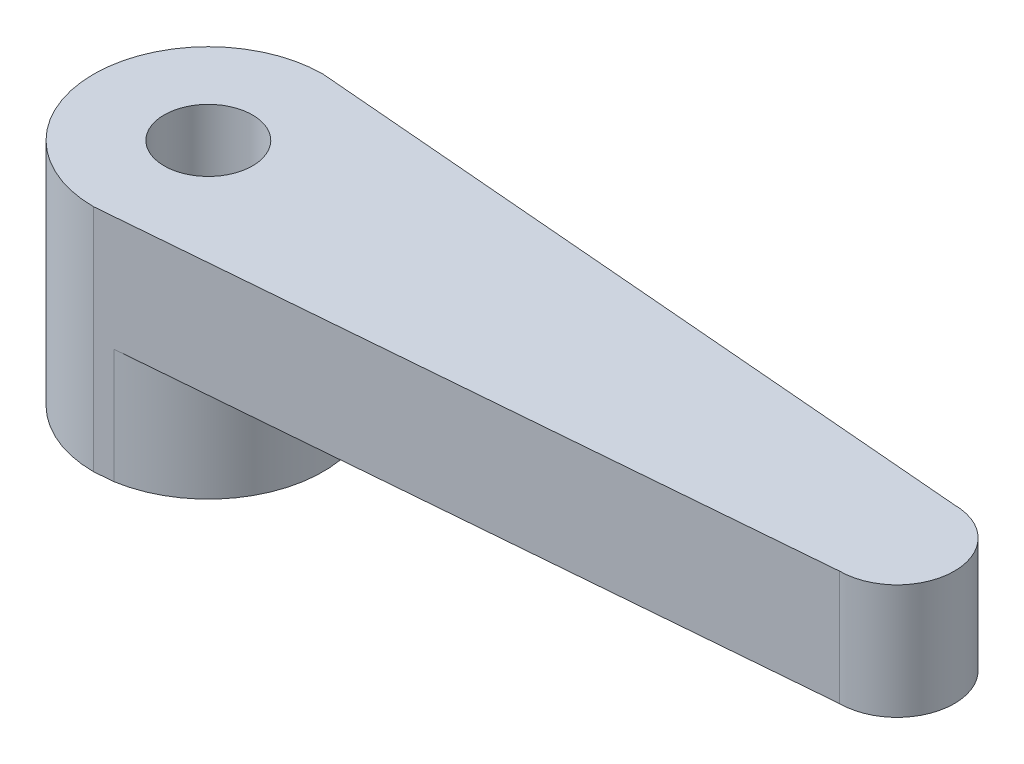
ISO-10303-21;
HEADER;
FILE_DESCRIPTION(('STEP AP214'),'2;1');
FILE_NAME('part.step','',(''),(''),'','','');
FILE_SCHEMA(('AUTOMOTIVE_DESIGN { 1 0 10303 214 1 1 1 1 }'));
ENDSEC;
DATA;
#1=APPLICATION_CONTEXT('core data for automotive mechanical design processes');
#2=APPLICATION_PROTOCOL_DEFINITION('international standard','automotive_design',2000,#1);
#3=PRODUCT_CONTEXT('',#1,'mechanical');
#4=PRODUCT('Part','Part','',(#3));
#5=PRODUCT_RELATED_PRODUCT_CATEGORY('part','',(#4));
#6=PRODUCT_DEFINITION_FORMATION('','',#4);
#7=PRODUCT_DEFINITION_CONTEXT('part definition',#1,'design');
#8=PRODUCT_DEFINITION('design','',#6,#7);
#9=PRODUCT_DEFINITION_SHAPE('','',#8);
#10=(LENGTH_UNIT() NAMED_UNIT(*) SI_UNIT(.MILLI.,.METRE.));
#11=(NAMED_UNIT(*) PLANE_ANGLE_UNIT() SI_UNIT($,.RADIAN.));
#12=(NAMED_UNIT(*) SI_UNIT($,.STERADIAN.) SOLID_ANGLE_UNIT());
#13=UNCERTAINTY_MEASURE_WITH_UNIT(LENGTH_MEASURE(1.E-05),#10,'distance_accuracy_value','');
#14=(GEOMETRIC_REPRESENTATION_CONTEXT(3) GLOBAL_UNCERTAINTY_ASSIGNED_CONTEXT((#13)) GLOBAL_UNIT_ASSIGNED_CONTEXT((#10,
#11,#12)) REPRESENTATION_CONTEXT('',''));
#15=CARTESIAN_POINT('',(0.,0.,0.));
#16=DIRECTION('',(0.,0.,1.));
#17=DIRECTION('',(1.,0.,0.));
#18=AXIS2_PLACEMENT_3D('',#15,#16,#17);
#19=CARTESIAN_POINT('',(0.413793103448276,5.,4.96551724137931));
#20=DIRECTION('',(-0.08304547985374,0.,-0.99654575824488));
#21=DIRECTION('',(-0.99654575824488,0.,0.08304547985374));
#22=AXIS2_PLACEMENT_3D('',#19,#20,#21);
#23=PLANE('',#22);
#24=DIRECTION('',(0.,-1.,0.));
#25=VECTOR('',#24,1.);
#26=CARTESIAN_POINT('',(0.,5.,5.));
#27=LINE('',#26,#25);
#28=CARTESIAN_POINT('',(0.,5.,5.));
#29=VERTEX_POINT('',#28);
#30=CARTESIAN_POINT('',(0.,-5.,5.));
#31=VERTEX_POINT('',#30);
#32=EDGE_CURVE('E130',#29,#31,#27,.T.);
#33=ORIENTED_EDGE('',*,*,#32,.T.);
#34=DIRECTION('',(0.99654575824488,0.,-0.08304547985374));
#35=VECTOR('',#34,1.);
#36=CARTESIAN_POINT('',(0.413793103448276,-5.,4.96551724137931));
#37=LINE('',#36,#35);
#38=CARTESIAN_POINT('',(0.827586206896551,-5.,4.93103448275862));
#39=VERTEX_POINT('',#38);
#40=EDGE_CURVE('E123',#31,#39,#37,.T.);
#41=ORIENTED_EDGE('',*,*,#40,.T.);
#42=DIRECTION('',(0.,1.,0.));
#43=VECTOR('',#42,1.);
#44=CARTESIAN_POINT('',(0.827586206896551,-5.,4.93103448275862));
#45=LINE('',#44,#43);
#46=CARTESIAN_POINT('',(0.827586206896551,0.,4.93103448275862));
#47=VERTEX_POINT('',#46);
#48=EDGE_CURVE('E108',#39,#47,#45,.T.);
#49=ORIENTED_EDGE('',*,*,#48,.T.);
#50=DIRECTION('',(0.99654575824488,0.,-0.08304547985374));
#51=VECTOR('',#50,1.);
#52=CARTESIAN_POINT('',(0.413793103448276,0.,4.96551724137931));
#53=LINE('',#52,#51);
#54=CARTESIAN_POINT('',(30.,0.,2.5));
#55=VERTEX_POINT('',#54);
#56=EDGE_CURVE('E145',#47,#55,#53,.T.);
#57=ORIENTED_EDGE('',*,*,#56,.T.);
#58=DIRECTION('',(0.,-1.,0.));
#59=VECTOR('',#58,1.);
#60=CARTESIAN_POINT('',(30.,5.,2.5));
#61=LINE('',#60,#59);
#62=CARTESIAN_POINT('',(30.,5.,2.5));
#63=VERTEX_POINT('',#62);
#64=EDGE_CURVE('E11',#63,#55,#61,.T.);
#65=ORIENTED_EDGE('',*,*,#64,.F.);
#66=DIRECTION('',(0.99654575824488,0.,-0.08304547985374));
#67=VECTOR('',#66,1.);
#68=CARTESIAN_POINT('',(0.413793103448276,5.,4.96551724137931));
#69=LINE('',#68,#67);
#70=EDGE_CURVE('E151',#29,#63,#69,.T.);
#71=ORIENTED_EDGE('',*,*,#70,.F.);
#72=EDGE_LOOP('',(#33,#41,#49,#57,#65,#71));
#73=FACE_BOUND('',#72,.T.);
#74=ADVANCED_FACE('F45',(#73),#23,.F.);
#75=CARTESIAN_POINT('',(30.,5.,0.));
#76=DIRECTION('',(0.,-1.,0.));
#77=DIRECTION('',(0.,0.,-1.));
#78=AXIS2_PLACEMENT_3D('',#75,#76,#77);
#79=CYLINDRICAL_SURFACE('',#78,2.5);
#80=CARTESIAN_POINT('',(30.,0.,0.));
#81=DIRECTION('',(0.,1.,0.));
#82=DIRECTION('',(0.,0.,1.));
#83=AXIS2_PLACEMENT_3D('',#80,#81,#82);
#84=CIRCLE('',#83,2.5);
#85=CARTESIAN_POINT('',(30.,0.,-2.5));
#86=VERTEX_POINT('',#85);
#87=EDGE_CURVE('E164',#55,#86,#84,.T.);
#88=ORIENTED_EDGE('',*,*,#87,.T.);
#89=DIRECTION('',(0.,-1.,0.));
#90=VECTOR('',#89,1.);
#91=CARTESIAN_POINT('',(30.,5.,-2.5));
#92=LINE('',#91,#90);
#93=CARTESIAN_POINT('',(30.,5.,-2.5));
#94=VERTEX_POINT('',#93);
#95=EDGE_CURVE('E54',#94,#86,#92,.T.);
#96=ORIENTED_EDGE('',*,*,#95,.F.);
#97=CARTESIAN_POINT('',(30.,5.,0.));
#98=DIRECTION('',(0.,1.,0.));
#99=DIRECTION('',(0.,0.,1.));
#100=AXIS2_PLACEMENT_3D('',#97,#98,#99);
#101=CIRCLE('',#100,2.5);
#102=EDGE_CURVE('E93',#63,#94,#101,.T.);
#103=ORIENTED_EDGE('',*,*,#102,.F.);
#104=ORIENTED_EDGE('',*,*,#64,.T.);
#105=EDGE_LOOP('',(#88,#96,#103,#104));
#106=FACE_BOUND('',#105,.T.);
#107=ADVANCED_FACE('F177',(#106),#79,.T.);
#108=CARTESIAN_POINT('',(0.413793103448276,5.,-4.96551724137931));
#109=DIRECTION('',(0.08304547985374,0.,-0.99654575824488));
#110=DIRECTION('',(-0.99654575824488,0.,-0.08304547985374));
#111=AXIS2_PLACEMENT_3D('',#108,#109,#110);
#112=PLANE('',#111);
#113=DIRECTION('',(0.99654575824488,0.,0.08304547985374));
#114=VECTOR('',#113,1.);
#115=CARTESIAN_POINT('',(0.413793103448276,0.,-4.96551724137931));
#116=LINE('',#115,#114);
#117=CARTESIAN_POINT('',(0.827586206896551,0.,-4.93103448275862));
#118=VERTEX_POINT('',#117);
#119=EDGE_CURVE('E86',#118,#86,#116,.T.);
#120=ORIENTED_EDGE('',*,*,#119,.F.);
#121=DIRECTION('',(0.,1.,0.));
#122=VECTOR('',#121,1.);
#123=CARTESIAN_POINT('',(0.827586206896551,-5.,-4.93103448275862));
#124=LINE('',#123,#122);
#125=CARTESIAN_POINT('',(0.827586206896551,-5.,-4.93103448275862));
#126=VERTEX_POINT('',#125);
#127=EDGE_CURVE('E61',#126,#118,#124,.T.);
#128=ORIENTED_EDGE('',*,*,#127,.F.);
#129=DIRECTION('',(0.99654575824488,0.,0.08304547985374));
#130=VECTOR('',#129,1.);
#131=CARTESIAN_POINT('',(0.413793103448276,-5.,-4.96551724137931));
#132=LINE('',#131,#130);
#133=CARTESIAN_POINT('',(0.,-5.,-5.));
#134=VERTEX_POINT('',#133);
#135=EDGE_CURVE('E126',#134,#126,#132,.T.);
#136=ORIENTED_EDGE('',*,*,#135,.F.);
#137=DIRECTION('',(0.,-1.,0.));
#138=VECTOR('',#137,1.);
#139=CARTESIAN_POINT('',(0.,5.,-5.));
#140=LINE('',#139,#138);
#141=CARTESIAN_POINT('',(0.,5.,-5.));
#142=VERTEX_POINT('',#141);
#143=EDGE_CURVE('E172',#142,#134,#140,.T.);
#144=ORIENTED_EDGE('',*,*,#143,.F.);
#145=DIRECTION('',(0.99654575824488,0.,0.08304547985374));
#146=VECTOR('',#145,1.);
#147=CARTESIAN_POINT('',(0.413793103448276,5.,-4.96551724137931));
#148=LINE('',#147,#146);
#149=EDGE_CURVE('E156',#142,#94,#148,.T.);
#150=ORIENTED_EDGE('',*,*,#149,.T.);
#151=ORIENTED_EDGE('',*,*,#95,.T.);
#152=EDGE_LOOP('',(#120,#128,#136,#144,#150,#151));
#153=FACE_BOUND('',#152,.T.);
#154=ADVANCED_FACE('F176',(#153),#112,.T.);
#155=CARTESIAN_POINT('',(0.,5.,0.));
#156=DIRECTION('',(0.,-1.,0.));
#157=DIRECTION('',(0.,0.,-1.));
#158=AXIS2_PLACEMENT_3D('',#155,#156,#157);
#159=CYLINDRICAL_SURFACE('',#158,1.925);
#160=CARTESIAN_POINT('',(0.,5.,0.));
#161=DIRECTION('',(0.,1.,0.));
#162=DIRECTION('',(0.,0.,1.));
#163=AXIS2_PLACEMENT_3D('',#160,#161,#162);
#164=CIRCLE('',#163,1.925);
#165=CARTESIAN_POINT('',(0.,5.,1.925));
#166=VERTEX_POINT('',#165);
#167=EDGE_CURVE('E147',#166,#166,#164,.T.);
#168=ORIENTED_EDGE('',*,*,#167,.T.);
#169=EDGE_LOOP('',(#168));
#170=FACE_BOUND('',#169,.T.);
#171=CARTESIAN_POINT('',(0.,-5.,0.));
#172=DIRECTION('',(0.,1.,0.));
#173=DIRECTION('',(0.,0.,1.));
#174=AXIS2_PLACEMENT_3D('',#171,#172,#173);
#175=CIRCLE('',#174,1.925);
#176=CARTESIAN_POINT('',(0.,-5.,1.925));
#177=VERTEX_POINT('',#176);
#178=EDGE_CURVE('E132',#177,#177,#175,.T.);
#179=ORIENTED_EDGE('',*,*,#178,.F.);
#180=EDGE_LOOP('',(#179));
#181=FACE_BOUND('',#180,.T.);
#182=ADVANCED_FACE('F47',(#170,#181),#159,.F.);
#183=CARTESIAN_POINT('',(0.,5.,0.));
#184=DIRECTION('',(0.,-1.,0.));
#185=DIRECTION('',(0.,0.,-1.));
#186=AXIS2_PLACEMENT_3D('',#183,#184,#185);
#187=CYLINDRICAL_SURFACE('',#186,5.);
#188=ORIENTED_EDGE('',*,*,#143,.T.);
#189=CARTESIAN_POINT('',(0.,-5.,0.));
#190=DIRECTION('',(0.,1.,0.));
#191=DIRECTION('',(0.,0.,1.));
#192=AXIS2_PLACEMENT_3D('',#189,#190,#191);
#193=CIRCLE('',#192,5.);
#194=EDGE_CURVE('E117',#134,#31,#193,.T.);
#195=ORIENTED_EDGE('',*,*,#194,.T.);
#196=ORIENTED_EDGE('',*,*,#32,.F.);
#197=CARTESIAN_POINT('',(0.,5.,0.));
#198=DIRECTION('',(0.,1.,0.));
#199=DIRECTION('',(0.,0.,1.));
#200=AXIS2_PLACEMENT_3D('',#197,#198,#199);
#201=CIRCLE('',#200,5.);
#202=EDGE_CURVE('E70',#142,#29,#201,.T.);
#203=ORIENTED_EDGE('',*,*,#202,.F.);
#204=EDGE_LOOP('',(#188,#195,#196,#203));
#205=FACE_BOUND('',#204,.T.);
#206=ADVANCED_FACE('F182',(#205),#187,.T.);
#207=CARTESIAN_POINT('',(0.,5.,0.));
#208=DIRECTION('',(0.,1.,0.));
#209=DIRECTION('',(0.,0.,1.));
#210=AXIS2_PLACEMENT_3D('',#207,#208,#209);
#211=PLANE('',#210);
#212=ORIENTED_EDGE('',*,*,#167,.F.);
#213=EDGE_LOOP('',(#212));
#214=FACE_BOUND('',#213,.T.);
#215=ORIENTED_EDGE('',*,*,#70,.T.);
#216=ORIENTED_EDGE('',*,*,#102,.T.);
#217=ORIENTED_EDGE('',*,*,#149,.F.);
#218=ORIENTED_EDGE('',*,*,#202,.T.);
#219=EDGE_LOOP('',(#215,#216,#217,#218));
#220=FACE_BOUND('',#219,.T.);
#221=ADVANCED_FACE('F180',(#214,#220),#211,.T.);
#222=CARTESIAN_POINT('',(0.,0.,0.));
#223=DIRECTION('',(0.,1.,0.));
#224=DIRECTION('',(0.,0.,1.));
#225=AXIS2_PLACEMENT_3D('',#222,#223,#224);
#226=PLANE('',#225);
#227=ORIENTED_EDGE('',*,*,#56,.F.);
#228=CARTESIAN_POINT('',(0.,0.,0.));
#229=DIRECTION('',(0.,1.,0.));
#230=DIRECTION('',(0.,0.,1.));
#231=AXIS2_PLACEMENT_3D('',#228,#229,#230);
#232=CIRCLE('',#231,5.);
#233=EDGE_CURVE('E112',#47,#118,#232,.T.);
#234=ORIENTED_EDGE('',*,*,#233,.T.);
#235=ORIENTED_EDGE('',*,*,#119,.T.);
#236=ORIENTED_EDGE('',*,*,#87,.F.);
#237=EDGE_LOOP('',(#227,#234,#235,#236));
#238=FACE_BOUND('',#237,.T.);
#239=ADVANCED_FACE('F179',(#238),#226,.F.);
#240=CARTESIAN_POINT('',(0.,-5.,0.));
#241=DIRECTION('',(0.,1.,0.));
#242=DIRECTION('',(0.,0.,1.));
#243=AXIS2_PLACEMENT_3D('',#240,#241,#242);
#244=CYLINDRICAL_SURFACE('',#243,5.);
#245=ORIENTED_EDGE('',*,*,#233,.F.);
#246=ORIENTED_EDGE('',*,*,#48,.F.);
#247=CARTESIAN_POINT('',(0.,-5.,0.));
#248=DIRECTION('',(0.,1.,0.));
#249=DIRECTION('',(0.,0.,1.));
#250=AXIS2_PLACEMENT_3D('',#247,#248,#249);
#251=CIRCLE('',#250,5.);
#252=EDGE_CURVE('E111',#39,#126,#251,.T.);
#253=ORIENTED_EDGE('',*,*,#252,.T.);
#254=ORIENTED_EDGE('',*,*,#127,.T.);
#255=EDGE_LOOP('',(#245,#246,#253,#254));
#256=FACE_BOUND('',#255,.T.);
#257=ADVANCED_FACE('F110',(#256),#244,.T.);
#258=CARTESIAN_POINT('',(0.,-5.,0.));
#259=DIRECTION('',(0.,1.,0.));
#260=DIRECTION('',(0.,0.,1.));
#261=AXIS2_PLACEMENT_3D('',#258,#259,#260);
#262=PLANE('',#261);
#263=ORIENTED_EDGE('',*,*,#178,.T.);
#264=EDGE_LOOP('',(#263));
#265=FACE_BOUND('',#264,.T.);
#266=ORIENTED_EDGE('',*,*,#40,.F.);
#267=ORIENTED_EDGE('',*,*,#194,.F.);
#268=ORIENTED_EDGE('',*,*,#135,.T.);
#269=ORIENTED_EDGE('',*,*,#252,.F.);
#270=EDGE_LOOP('',(#266,#267,#268,#269));
#271=FACE_BOUND('',#270,.T.);
#272=ADVANCED_FACE('F121',(#265,#271),#262,.F.);
#273=CLOSED_SHELL('',(#74,#107,#154,#182,#206,#221,#239,#257,#272));
#274=MANIFOLD_SOLID_BREP('B2',#273);
#275=ADVANCED_BREP_SHAPE_REPRESENTATION('',(#18,#274),#14);
#276=SHAPE_DEFINITION_REPRESENTATION(#9,#275);
ENDSEC;
END-ISO-10303-21;
